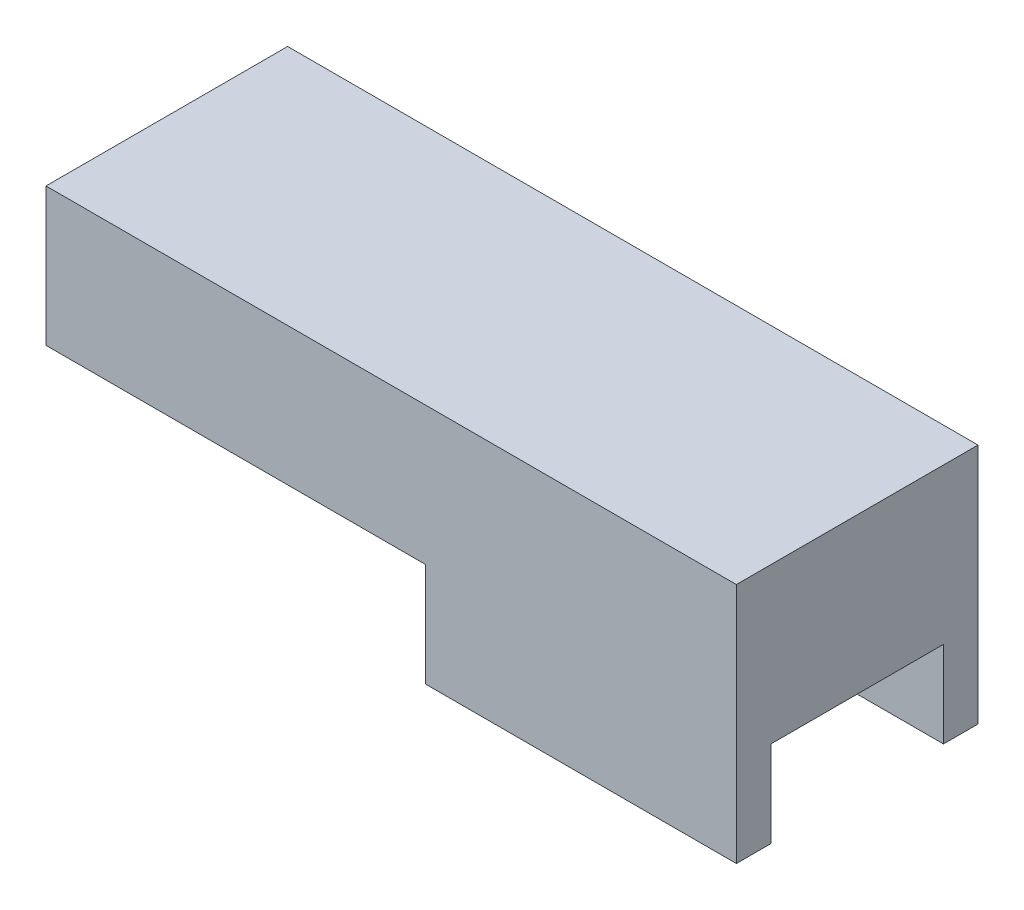
ISO-10303-21;
HEADER;
FILE_DESCRIPTION(('STEP AP214'),'2;1');
FILE_NAME('part.step','',(''),(''),'','','');
FILE_SCHEMA(('AUTOMOTIVE_DESIGN { 1 0 10303 214 1 1 1 1 }'));
ENDSEC;
DATA;
#1=APPLICATION_CONTEXT('core data for automotive mechanical design processes');
#2=APPLICATION_PROTOCOL_DEFINITION('international standard','automotive_design',2000,#1);
#3=PRODUCT_CONTEXT('',#1,'mechanical');
#4=PRODUCT('Part','Part','',(#3));
#5=PRODUCT_RELATED_PRODUCT_CATEGORY('part','',(#4));
#6=PRODUCT_DEFINITION_FORMATION('','',#4);
#7=PRODUCT_DEFINITION_CONTEXT('part definition',#1,'design');
#8=PRODUCT_DEFINITION('design','',#6,#7);
#9=PRODUCT_DEFINITION_SHAPE('','',#8);
#10=(LENGTH_UNIT() NAMED_UNIT(*) SI_UNIT(.MILLI.,.METRE.));
#11=(NAMED_UNIT(*) PLANE_ANGLE_UNIT() SI_UNIT($,.RADIAN.));
#12=(NAMED_UNIT(*) SI_UNIT($,.STERADIAN.) SOLID_ANGLE_UNIT());
#13=UNCERTAINTY_MEASURE_WITH_UNIT(LENGTH_MEASURE(1.E-05),#10,'distance_accuracy_value','');
#14=(GEOMETRIC_REPRESENTATION_CONTEXT(3) GLOBAL_UNCERTAINTY_ASSIGNED_CONTEXT((#13)) GLOBAL_UNIT_ASSIGNED_CONTEXT((#10,
#11,#12)) REPRESENTATION_CONTEXT('',''));
#15=CARTESIAN_POINT('',(0.,0.,0.));
#16=DIRECTION('',(0.,0.,1.));
#17=DIRECTION('',(1.,0.,0.));
#18=AXIS2_PLACEMENT_3D('',#15,#16,#17);
#19=CARTESIAN_POINT('',(157.438016528926,-39.0491451001224,70.));
#20=DIRECTION('',(0.,1.,0.));
#21=DIRECTION('',(-1.,0.,0.));
#22=AXIS2_PLACEMENT_3D('',#19,#20,#21);
#23=PLANE('',#22);
#24=DIRECTION('',(0.,0.,-1.));
#25=VECTOR('',#24,1.);
#26=CARTESIAN_POINT('',(157.438016528926,-39.0491451001224,70.));
#27=LINE('',#26,#25);
#28=CARTESIAN_POINT('',(157.438016528926,-39.0491451001225,10.));
#29=VERTEX_POINT('',#28);
#30=CARTESIAN_POINT('',(157.438016528926,-39.0491451001224,0.));
#31=VERTEX_POINT('',#30);
#32=EDGE_CURVE('E133',#29,#31,#27,.T.);
#33=ORIENTED_EDGE('',*,*,#32,.F.);
#34=DIRECTION('',(-1.,0.,0.));
#35=VECTOR('',#34,1.);
#36=CARTESIAN_POINT('',(157.438016528926,-39.0491451001225,10.));
#37=LINE('',#36,#35);
#38=CARTESIAN_POINT('',(67.4380165289256,-39.0491451001224,10.));
#39=VERTEX_POINT('',#38);
#40=EDGE_CURVE('E149',#29,#39,#37,.T.);
#41=ORIENTED_EDGE('',*,*,#40,.T.);
#42=DIRECTION('',(0.,0.,-1.));
#43=VECTOR('',#42,1.);
#44=CARTESIAN_POINT('',(67.4380165289256,-39.0491451001224,70.));
#45=LINE('',#44,#43);
#46=CARTESIAN_POINT('',(67.4380165289256,-39.0491451001224,0.));
#47=VERTEX_POINT('',#46);
#48=EDGE_CURVE('E132',#39,#47,#45,.T.);
#49=ORIENTED_EDGE('',*,*,#48,.T.);
#50=DIRECTION('',(1.,0.,0.));
#51=VECTOR('',#50,1.);
#52=CARTESIAN_POINT('',(157.438016528926,-39.0491451001224,0.));
#53=LINE('',#52,#51);
#54=EDGE_CURVE('E156',#47,#31,#53,.T.);
#55=ORIENTED_EDGE('',*,*,#54,.T.);
#56=EDGE_LOOP('',(#33,#41,#49,#55));
#57=FACE_BOUND('',#56,.T.);
#58=ADVANCED_FACE('F39',(#57),#23,.F.);
#59=CARTESIAN_POINT('',(-42.5619834710744,-9.04914510012242,70.));
#60=DIRECTION('',(1.,0.,0.));
#61=DIRECTION('',(0.,0.,-1.));
#62=AXIS2_PLACEMENT_3D('',#59,#60,#61);
#63=PLANE('',#62);
#64=DIRECTION('',(0.,-1.,0.));
#65=VECTOR('',#64,1.);
#66=CARTESIAN_POINT('',(-42.5619834710744,-9.04914510012242,0.));
#67=LINE('',#66,#65);
#68=CARTESIAN_POINT('',(-42.5619834710744,30.9508548998776,0.));
#69=VERTEX_POINT('',#68);
#70=CARTESIAN_POINT('',(-42.5619834710744,-9.04914510012242,0.));
#71=VERTEX_POINT('',#70);
#72=EDGE_CURVE('E144',#69,#71,#67,.T.);
#73=ORIENTED_EDGE('',*,*,#72,.T.);
#74=DIRECTION('',(0.,0.,-1.));
#75=VECTOR('',#74,1.);
#76=CARTESIAN_POINT('',(-42.5619834710744,-9.04914510012242,70.));
#77=LINE('',#76,#75);
#78=CARTESIAN_POINT('',(-42.5619834710744,-9.04914510012242,70.));
#79=VERTEX_POINT('',#78);
#80=EDGE_CURVE('E11',#79,#71,#77,.T.);
#81=ORIENTED_EDGE('',*,*,#80,.F.);
#82=DIRECTION('',(0.,-1.,0.));
#83=VECTOR('',#82,1.);
#84=CARTESIAN_POINT('',(-42.5619834710744,-9.04914510012242,70.));
#85=LINE('',#84,#83);
#86=CARTESIAN_POINT('',(-42.5619834710744,30.9508548998776,70.));
#87=VERTEX_POINT('',#86);
#88=EDGE_CURVE('E165',#87,#79,#85,.T.);
#89=ORIENTED_EDGE('',*,*,#88,.F.);
#90=DIRECTION('',(0.,0.,-1.));
#91=VECTOR('',#90,1.);
#92=CARTESIAN_POINT('',(-42.5619834710744,30.9508548998776,70.));
#93=LINE('',#92,#91);
#94=EDGE_CURVE('E140',#87,#69,#93,.T.);
#95=ORIENTED_EDGE('',*,*,#94,.T.);
#96=EDGE_LOOP('',(#73,#81,#89,#95));
#97=FACE_BOUND('',#96,.T.);
#98=ADVANCED_FACE('F41',(#97),#63,.F.);
#99=CARTESIAN_POINT('',(67.4380165289256,-9.04914510012241,70.));
#100=DIRECTION('',(0.,1.,0.));
#101=DIRECTION('',(-1.,0.,0.));
#102=AXIS2_PLACEMENT_3D('',#99,#100,#101);
#103=PLANE('',#102);
#104=DIRECTION('',(1.,0.,0.));
#105=VECTOR('',#104,1.);
#106=CARTESIAN_POINT('',(67.4380165289256,-9.04914510012241,0.));
#107=LINE('',#106,#105);
#108=CARTESIAN_POINT('',(67.4380165289256,-9.04914510012241,0.));
#109=VERTEX_POINT('',#108);
#110=EDGE_CURVE('E148',#71,#109,#107,.T.);
#111=ORIENTED_EDGE('',*,*,#110,.T.);
#112=DIRECTION('',(0.,0.,-1.));
#113=VECTOR('',#112,1.);
#114=CARTESIAN_POINT('',(67.4380165289256,-9.04914510012241,70.));
#115=LINE('',#114,#113);
#116=CARTESIAN_POINT('',(67.4380165289256,-9.04914510012241,70.));
#117=VERTEX_POINT('',#116);
#118=EDGE_CURVE('E48',#117,#109,#115,.T.);
#119=ORIENTED_EDGE('',*,*,#118,.F.);
#120=DIRECTION('',(1.,0.,0.));
#121=VECTOR('',#120,1.);
#122=CARTESIAN_POINT('',(67.4380165289256,-9.04914510012241,70.));
#123=LINE('',#122,#121);
#124=EDGE_CURVE('E99',#79,#117,#123,.T.);
#125=ORIENTED_EDGE('',*,*,#124,.F.);
#126=ORIENTED_EDGE('',*,*,#80,.T.);
#127=EDGE_LOOP('',(#111,#119,#125,#126));
#128=FACE_BOUND('',#127,.T.);
#129=ADVANCED_FACE('F233',(#128),#103,.F.);
#130=CARTESIAN_POINT('',(67.4380165289256,-39.0491451001224,70.));
#131=DIRECTION('',(1.,0.,0.));
#132=DIRECTION('',(0.,1.,0.));
#133=AXIS2_PLACEMENT_3D('',#130,#131,#132);
#134=PLANE('',#133);
#135=ORIENTED_EDGE('',*,*,#48,.F.);
#136=DIRECTION('',(0.,-1.,0.));
#137=VECTOR('',#136,1.);
#138=CARTESIAN_POINT('',(67.4380165289256,-39.0491451001224,10.));
#139=LINE('',#138,#137);
#140=CARTESIAN_POINT('',(67.4380165289256,-14.0491451001224,10.));
#141=VERTEX_POINT('',#140);
#142=EDGE_CURVE('E215',#141,#39,#139,.T.);
#143=ORIENTED_EDGE('',*,*,#142,.F.);
#144=DIRECTION('',(0.,0.,-1.));
#145=VECTOR('',#144,1.);
#146=CARTESIAN_POINT('',(67.4380165289256,-14.0491451001224,10.));
#147=LINE('',#146,#145);
#148=CARTESIAN_POINT('',(67.4380165289256,-14.0491451001224,60.));
#149=VERTEX_POINT('',#148);
#150=EDGE_CURVE('E211',#149,#141,#147,.T.);
#151=ORIENTED_EDGE('',*,*,#150,.F.);
#152=DIRECTION('',(0.,1.,0.));
#153=VECTOR('',#152,1.);
#154=CARTESIAN_POINT('',(67.4380165289256,-14.0491451001224,60.));
#155=LINE('',#154,#153);
#156=CARTESIAN_POINT('',(67.4380165289256,-39.0491451001224,60.));
#157=VERTEX_POINT('',#156);
#158=EDGE_CURVE('E207',#157,#149,#155,.T.);
#159=ORIENTED_EDGE('',*,*,#158,.F.);
#160=CARTESIAN_POINT('',(67.4380165289256,-39.0491451001224,70.));
#161=VERTEX_POINT('',#160);
#162=EDGE_CURVE('E170',#161,#157,#45,.T.);
#163=ORIENTED_EDGE('',*,*,#162,.F.);
#164=DIRECTION('',(0.,-1.,0.));
#165=VECTOR('',#164,1.);
#166=CARTESIAN_POINT('',(67.4380165289256,-39.0491451001224,70.));
#167=LINE('',#166,#165);
#168=EDGE_CURVE('E116',#117,#161,#167,.T.);
#169=ORIENTED_EDGE('',*,*,#168,.F.);
#170=ORIENTED_EDGE('',*,*,#118,.T.);
#171=DIRECTION('',(0.,-1.,0.));
#172=VECTOR('',#171,1.);
#173=CARTESIAN_POINT('',(67.4380165289256,-39.0491451001224,0.));
#174=LINE('',#173,#172);
#175=EDGE_CURVE('E152',#109,#47,#174,.T.);
#176=ORIENTED_EDGE('',*,*,#175,.T.);
#177=EDGE_LOOP('',(#135,#143,#151,#159,#163,#169,#170,#176));
#178=FACE_BOUND('',#177,.T.);
#179=ADVANCED_FACE('F177',(#178),#134,.F.);
#180=ORIENTED_EDGE('',*,*,#162,.T.);
#181=DIRECTION('',(-1.,0.,0.));
#182=VECTOR('',#181,1.);
#183=CARTESIAN_POINT('',(157.438016528926,-39.0491451001225,60.));
#184=LINE('',#183,#182);
#185=CARTESIAN_POINT('',(157.438016528926,-39.0491451001225,60.));
#186=VERTEX_POINT('',#185);
#187=EDGE_CURVE('E128',#186,#157,#184,.T.);
#188=ORIENTED_EDGE('',*,*,#187,.F.);
#189=CARTESIAN_POINT('',(157.438016528926,-39.0491451001224,70.));
#190=VERTEX_POINT('',#189);
#191=EDGE_CURVE('E124',#190,#186,#27,.T.);
#192=ORIENTED_EDGE('',*,*,#191,.F.);
#193=DIRECTION('',(1.,0.,0.));
#194=VECTOR('',#193,1.);
#195=CARTESIAN_POINT('',(157.438016528926,-39.0491451001224,70.));
#196=LINE('',#195,#194);
#197=EDGE_CURVE('E109',#161,#190,#196,.T.);
#198=ORIENTED_EDGE('',*,*,#197,.F.);
#199=EDGE_LOOP('',(#180,#188,#192,#198));
#200=FACE_BOUND('',#199,.T.);
#201=ADVANCED_FACE('F125',(#200),#23,.F.);
#202=CARTESIAN_POINT('',(157.438016528926,30.9508548998776,70.));
#203=DIRECTION('',(-1.,0.,0.));
#204=DIRECTION('',(0.,-1.,0.));
#205=AXIS2_PLACEMENT_3D('',#202,#203,#204);
#206=PLANE('',#205);
#207=DIRECTION('',(0.,0.,-1.));
#208=VECTOR('',#207,1.);
#209=CARTESIAN_POINT('',(157.438016528926,-14.0491451001225,10.));
#210=LINE('',#209,#208);
#211=CARTESIAN_POINT('',(157.438016528926,-14.0491451001224,60.));
#212=VERTEX_POINT('',#211);
#213=CARTESIAN_POINT('',(157.438016528926,-14.0491451001225,10.));
#214=VERTEX_POINT('',#213);
#215=EDGE_CURVE('E55',#212,#214,#210,.T.);
#216=ORIENTED_EDGE('',*,*,#215,.T.);
#217=DIRECTION('',(0.,-1.,0.));
#218=VECTOR('',#217,1.);
#219=CARTESIAN_POINT('',(157.438016528926,-39.0491451001225,10.));
#220=LINE('',#219,#218);
#221=EDGE_CURVE('E192',#214,#29,#220,.T.);
#222=ORIENTED_EDGE('',*,*,#221,.T.);
#223=ORIENTED_EDGE('',*,*,#32,.T.);
#224=DIRECTION('',(0.,1.,0.));
#225=VECTOR('',#224,1.);
#226=CARTESIAN_POINT('',(157.438016528926,30.9508548998776,0.));
#227=LINE('',#226,#225);
#228=CARTESIAN_POINT('',(157.438016528926,30.9508548998776,0.));
#229=VERTEX_POINT('',#228);
#230=EDGE_CURVE('E160',#31,#229,#227,.T.);
#231=ORIENTED_EDGE('',*,*,#230,.T.);
#232=DIRECTION('',(0.,0.,-1.));
#233=VECTOR('',#232,1.);
#234=CARTESIAN_POINT('',(157.438016528926,30.9508548998776,70.));
#235=LINE('',#234,#233);
#236=CARTESIAN_POINT('',(157.438016528926,30.9508548998776,70.));
#237=VERTEX_POINT('',#236);
#238=EDGE_CURVE('E136',#237,#229,#235,.T.);
#239=ORIENTED_EDGE('',*,*,#238,.F.);
#240=DIRECTION('',(0.,1.,0.));
#241=VECTOR('',#240,1.);
#242=CARTESIAN_POINT('',(157.438016528926,30.9508548998776,70.));
#243=LINE('',#242,#241);
#244=EDGE_CURVE('E113',#190,#237,#243,.T.);
#245=ORIENTED_EDGE('',*,*,#244,.F.);
#246=ORIENTED_EDGE('',*,*,#191,.T.);
#247=DIRECTION('',(0.,1.,0.));
#248=VECTOR('',#247,1.);
#249=CARTESIAN_POINT('',(157.438016528926,-14.0491451001225,60.));
#250=LINE('',#249,#248);
#251=EDGE_CURVE('E203',#186,#212,#250,.T.);
#252=ORIENTED_EDGE('',*,*,#251,.T.);
#253=EDGE_LOOP('',(#216,#222,#223,#231,#239,#245,#246,#252));
#254=FACE_BOUND('',#253,.T.);
#255=ADVANCED_FACE('F135',(#254),#206,.F.);
#256=CARTESIAN_POINT('',(-42.5619834710744,30.9508548998776,70.));
#257=DIRECTION('',(0.,-1.,0.));
#258=DIRECTION('',(0.,0.,-1.));
#259=AXIS2_PLACEMENT_3D('',#256,#257,#258);
#260=PLANE('',#259);
#261=DIRECTION('',(-1.,0.,0.));
#262=VECTOR('',#261,1.);
#263=CARTESIAN_POINT('',(-42.5619834710744,30.9508548998776,0.));
#264=LINE('',#263,#262);
#265=EDGE_CURVE('E91',#229,#69,#264,.T.);
#266=ORIENTED_EDGE('',*,*,#265,.T.);
#267=ORIENTED_EDGE('',*,*,#94,.F.);
#268=DIRECTION('',(-1.,0.,0.));
#269=VECTOR('',#268,1.);
#270=CARTESIAN_POINT('',(-42.5619834710744,30.9508548998776,70.));
#271=LINE('',#270,#269);
#272=EDGE_CURVE('E64',#237,#87,#271,.T.);
#273=ORIENTED_EDGE('',*,*,#272,.F.);
#274=ORIENTED_EDGE('',*,*,#238,.T.);
#275=EDGE_LOOP('',(#266,#267,#273,#274));
#276=FACE_BOUND('',#275,.T.);
#277=ADVANCED_FACE('F249',(#276),#260,.F.);
#278=CARTESIAN_POINT('',(0.,0.,70.));
#279=DIRECTION('',(0.,0.,-1.));
#280=DIRECTION('',(-1.,0.,0.));
#281=AXIS2_PLACEMENT_3D('',#278,#279,#280);
#282=PLANE('',#281);
#283=ORIENTED_EDGE('',*,*,#88,.T.);
#284=ORIENTED_EDGE('',*,*,#124,.T.);
#285=ORIENTED_EDGE('',*,*,#168,.T.);
#286=ORIENTED_EDGE('',*,*,#197,.T.);
#287=ORIENTED_EDGE('',*,*,#244,.T.);
#288=ORIENTED_EDGE('',*,*,#272,.T.);
#289=EDGE_LOOP('',(#283,#284,#285,#286,#287,#288));
#290=FACE_BOUND('',#289,.T.);
#291=ADVANCED_FACE('F111',(#290),#282,.F.);
#292=CARTESIAN_POINT('',(0.,0.,0.));
#293=DIRECTION('',(0.,0.,-1.));
#294=DIRECTION('',(-1.,0.,0.));
#295=AXIS2_PLACEMENT_3D('',#292,#293,#294);
#296=PLANE('',#295);
#297=ORIENTED_EDGE('',*,*,#72,.F.);
#298=ORIENTED_EDGE('',*,*,#265,.F.);
#299=ORIENTED_EDGE('',*,*,#230,.F.);
#300=ORIENTED_EDGE('',*,*,#54,.F.);
#301=ORIENTED_EDGE('',*,*,#175,.F.);
#302=ORIENTED_EDGE('',*,*,#110,.F.);
#303=EDGE_LOOP('',(#297,#298,#299,#300,#301,#302));
#304=FACE_BOUND('',#303,.T.);
#305=ADVANCED_FACE('F181',(#304),#296,.T.);
#306=CARTESIAN_POINT('',(157.438016528926,-39.0491451001225,10.));
#307=DIRECTION('',(0.,0.,-1.));
#308=DIRECTION('',(0.,1.,0.));
#309=AXIS2_PLACEMENT_3D('',#306,#307,#308);
#310=PLANE('',#309);
#311=ORIENTED_EDGE('',*,*,#142,.T.);
#312=ORIENTED_EDGE('',*,*,#40,.F.);
#313=ORIENTED_EDGE('',*,*,#221,.F.);
#314=DIRECTION('',(-1.,0.,0.));
#315=VECTOR('',#314,1.);
#316=CARTESIAN_POINT('',(157.438016528926,-14.0491451001225,10.));
#317=LINE('',#316,#315);
#318=EDGE_CURVE('E221',#214,#141,#317,.T.);
#319=ORIENTED_EDGE('',*,*,#318,.T.);
#320=EDGE_LOOP('',(#311,#312,#313,#319));
#321=FACE_BOUND('',#320,.T.);
#322=ADVANCED_FACE('F257',(#321),#310,.F.);
#323=CARTESIAN_POINT('',(157.438016528926,-14.0491451001225,10.));
#324=DIRECTION('',(0.,1.,0.));
#325=DIRECTION('',(-1.,0.,0.));
#326=AXIS2_PLACEMENT_3D('',#323,#324,#325);
#327=PLANE('',#326);
#328=ORIENTED_EDGE('',*,*,#150,.T.);
#329=ORIENTED_EDGE('',*,*,#318,.F.);
#330=ORIENTED_EDGE('',*,*,#215,.F.);
#331=DIRECTION('',(-1.,0.,0.));
#332=VECTOR('',#331,1.);
#333=CARTESIAN_POINT('',(157.438016528926,-14.0491451001225,60.));
#334=LINE('',#333,#332);
#335=EDGE_CURVE('E201',#212,#149,#334,.T.);
#336=ORIENTED_EDGE('',*,*,#335,.T.);
#337=EDGE_LOOP('',(#328,#329,#330,#336));
#338=FACE_BOUND('',#337,.T.);
#339=ADVANCED_FACE('F263',(#338),#327,.F.);
#340=CARTESIAN_POINT('',(157.438016528926,-14.0491451001225,60.));
#341=DIRECTION('',(0.,0.,1.));
#342=DIRECTION('',(0.,-1.,0.));
#343=AXIS2_PLACEMENT_3D('',#340,#341,#342);
#344=PLANE('',#343);
#345=ORIENTED_EDGE('',*,*,#158,.T.);
#346=ORIENTED_EDGE('',*,*,#335,.F.);
#347=ORIENTED_EDGE('',*,*,#251,.F.);
#348=ORIENTED_EDGE('',*,*,#187,.T.);
#349=EDGE_LOOP('',(#345,#346,#347,#348));
#350=FACE_BOUND('',#349,.T.);
#351=ADVANCED_FACE('F260',(#350),#344,.F.);
#352=CLOSED_SHELL('',(#58,#98,#129,#179,#201,#255,#277,#291,#305,#322,#339,#351));
#353=MANIFOLD_SOLID_BREP('B2',#352);
#354=ADVANCED_BREP_SHAPE_REPRESENTATION('',(#18,#353),#14);
#355=SHAPE_DEFINITION_REPRESENTATION(#9,#354);
ENDSEC;
END-ISO-10303-21;
